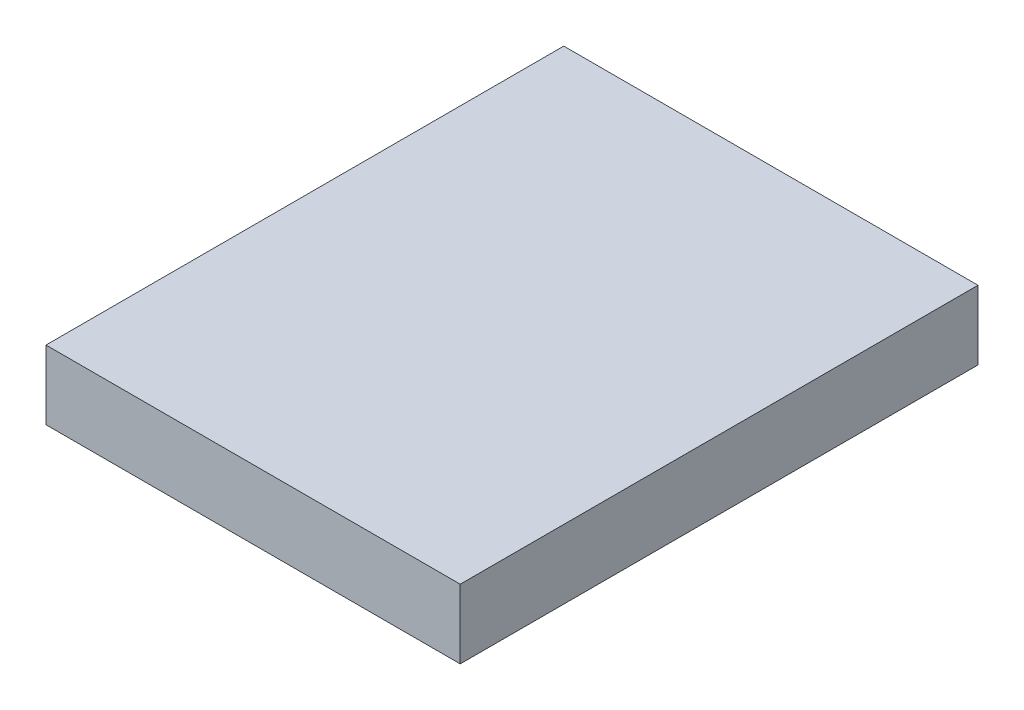
ISO-10303-21;
HEADER;
FILE_DESCRIPTION(('STEP AP214'),'2;1');
FILE_NAME('part.step','',(''),(''),'','','');
FILE_SCHEMA(('AUTOMOTIVE_DESIGN { 1 0 10303 214 1 1 1 1 }'));
ENDSEC;
DATA;
#1=APPLICATION_CONTEXT('core data for automotive mechanical design processes');
#2=APPLICATION_PROTOCOL_DEFINITION('international standard','automotive_design',2000,#1);
#3=PRODUCT_CONTEXT('',#1,'mechanical');
#4=PRODUCT('Part','Part','',(#3));
#5=PRODUCT_RELATED_PRODUCT_CATEGORY('part','',(#4));
#6=PRODUCT_DEFINITION_FORMATION('','',#4);
#7=PRODUCT_DEFINITION_CONTEXT('part definition',#1,'design');
#8=PRODUCT_DEFINITION('design','',#6,#7);
#9=PRODUCT_DEFINITION_SHAPE('','',#8);
#10=(LENGTH_UNIT() NAMED_UNIT(*) SI_UNIT(.MILLI.,.METRE.));
#11=(NAMED_UNIT(*) PLANE_ANGLE_UNIT() SI_UNIT($,.RADIAN.));
#12=(NAMED_UNIT(*) SI_UNIT($,.STERADIAN.) SOLID_ANGLE_UNIT());
#13=UNCERTAINTY_MEASURE_WITH_UNIT(LENGTH_MEASURE(1.E-05),#10,'distance_accuracy_value','');
#14=(GEOMETRIC_REPRESENTATION_CONTEXT(3) GLOBAL_UNCERTAINTY_ASSIGNED_CONTEXT((#13)) GLOBAL_UNIT_ASSIGNED_CONTEXT((#10,
#11,#12)) REPRESENTATION_CONTEXT('',''));
#15=CARTESIAN_POINT('',(0.,0.,0.));
#16=DIRECTION('',(0.,0.,1.));
#17=DIRECTION('',(1.,0.,0.));
#18=AXIS2_PLACEMENT_3D('',#15,#16,#17);
#19=CARTESIAN_POINT('',(0.,-1.,0.));
#20=DIRECTION('',(0.,0.,-1.));
#21=DIRECTION('',(-1.,0.,0.));
#22=AXIS2_PLACEMENT_3D('',#19,#20,#21);
#23=PLANE('',#22);
#24=DIRECTION('',(-1.,0.,0.));
#25=VECTOR('',#24,1.);
#26=CARTESIAN_POINT('',(0.,0.,0.));
#27=LINE('',#26,#25);
#28=CARTESIAN_POINT('',(6.00000000000001,0.,0.));
#29=VERTEX_POINT('',#28);
#30=CARTESIAN_POINT('',(0.,0.,0.));
#31=VERTEX_POINT('',#30);
#32=EDGE_CURVE('E80',#29,#31,#27,.T.);
#33=ORIENTED_EDGE('',*,*,#32,.F.);
#34=DIRECTION('',(0.,1.,0.));
#35=VECTOR('',#34,1.);
#36=CARTESIAN_POINT('',(6.00000000000001,-1.,0.));
#37=LINE('',#36,#35);
#38=CARTESIAN_POINT('',(6.00000000000001,-1.,0.));
#39=VERTEX_POINT('',#38);
#40=EDGE_CURVE('E73',#39,#29,#37,.T.);
#41=ORIENTED_EDGE('',*,*,#40,.F.);
#42=DIRECTION('',(-1.,0.,0.));
#43=VECTOR('',#42,1.);
#44=CARTESIAN_POINT('',(0.,-1.,0.));
#45=LINE('',#44,#43);
#46=CARTESIAN_POINT('',(0.,-1.,0.));
#47=VERTEX_POINT('',#46);
#48=EDGE_CURVE('E40',#39,#47,#45,.T.);
#49=ORIENTED_EDGE('',*,*,#48,.T.);
#50=DIRECTION('',(0.,1.,0.));
#51=VECTOR('',#50,1.);
#52=CARTESIAN_POINT('',(0.,-1.,0.));
#53=LINE('',#52,#51);
#54=EDGE_CURVE('E11',#47,#31,#53,.T.);
#55=ORIENTED_EDGE('',*,*,#54,.T.);
#56=EDGE_LOOP('',(#33,#41,#49,#55));
#57=FACE_BOUND('',#56,.T.);
#58=ADVANCED_FACE('F32',(#57),#23,.T.);
#59=CARTESIAN_POINT('',(0.,-1.,0.));
#60=DIRECTION('',(0.,1.,0.));
#61=DIRECTION('',(0.,0.,1.));
#62=AXIS2_PLACEMENT_3D('',#59,#60,#61);
#63=PLANE('',#62);
#64=DIRECTION('',(0.,0.,-1.));
#65=VECTOR('',#64,1.);
#66=CARTESIAN_POINT('',(6.00000000000001,-1.,0.));
#67=LINE('',#66,#65);
#68=CARTESIAN_POINT('',(6.,-1.,7.5));
#69=VERTEX_POINT('',#68);
#70=EDGE_CURVE('E71',#69,#39,#67,.T.);
#71=ORIENTED_EDGE('',*,*,#70,.F.);
#72=DIRECTION('',(-1.,0.,0.));
#73=VECTOR('',#72,1.);
#74=CARTESIAN_POINT('',(6.,-1.,7.5));
#75=LINE('',#74,#73);
#76=CARTESIAN_POINT('',(0.,-1.,7.5));
#77=VERTEX_POINT('',#76);
#78=EDGE_CURVE('E100',#69,#77,#75,.T.);
#79=ORIENTED_EDGE('',*,*,#78,.T.);
#80=DIRECTION('',(0.,0.,1.));
#81=VECTOR('',#80,1.);
#82=CARTESIAN_POINT('',(0.,-1.,0.));
#83=LINE('',#82,#81);
#84=EDGE_CURVE('E85',#47,#77,#83,.T.);
#85=ORIENTED_EDGE('',*,*,#84,.F.);
#86=ORIENTED_EDGE('',*,*,#48,.F.);
#87=EDGE_LOOP('',(#71,#79,#85,#86));
#88=FACE_BOUND('',#87,.T.);
#89=ADVANCED_FACE('F83',(#88),#63,.F.);
#90=CARTESIAN_POINT('',(0.,0.,0.));
#91=DIRECTION('',(0.,1.,0.));
#92=DIRECTION('',(0.,0.,1.));
#93=AXIS2_PLACEMENT_3D('',#90,#91,#92);
#94=PLANE('',#93);
#95=DIRECTION('',(-1.,0.,0.));
#96=VECTOR('',#95,1.);
#97=CARTESIAN_POINT('',(6.,0.,7.5));
#98=LINE('',#97,#96);
#99=CARTESIAN_POINT('',(6.,0.,7.5));
#100=VERTEX_POINT('',#99);
#101=CARTESIAN_POINT('',(0.,0.,7.5));
#102=VERTEX_POINT('',#101);
#103=EDGE_CURVE('E103',#100,#102,#98,.T.);
#104=ORIENTED_EDGE('',*,*,#103,.F.);
#105=DIRECTION('',(0.,0.,-1.));
#106=VECTOR('',#105,1.);
#107=CARTESIAN_POINT('',(6.00000000000001,0.,0.));
#108=LINE('',#107,#106);
#109=EDGE_CURVE('E47',#100,#29,#108,.T.);
#110=ORIENTED_EDGE('',*,*,#109,.T.);
#111=ORIENTED_EDGE('',*,*,#32,.T.);
#112=DIRECTION('',(0.,0.,1.));
#113=VECTOR('',#112,1.);
#114=CARTESIAN_POINT('',(0.,0.,0.));
#115=LINE('',#114,#113);
#116=EDGE_CURVE('E90',#31,#102,#115,.T.);
#117=ORIENTED_EDGE('',*,*,#116,.T.);
#118=EDGE_LOOP('',(#104,#110,#111,#117));
#119=FACE_BOUND('',#118,.T.);
#120=ADVANCED_FACE('F94',(#119),#94,.T.);
#121=CARTESIAN_POINT('',(0.,-1.,0.));
#122=DIRECTION('',(-1.,0.,0.));
#123=DIRECTION('',(0.,0.,1.));
#124=AXIS2_PLACEMENT_3D('',#121,#122,#123);
#125=PLANE('',#124);
#126=DIRECTION('',(0.,1.,0.));
#127=VECTOR('',#126,1.);
#128=CARTESIAN_POINT('',(0.,-1.,7.5));
#129=LINE('',#128,#127);
#130=EDGE_CURVE('E98',#77,#102,#129,.T.);
#131=ORIENTED_EDGE('',*,*,#130,.T.);
#132=ORIENTED_EDGE('',*,*,#116,.F.);
#133=ORIENTED_EDGE('',*,*,#54,.F.);
#134=ORIENTED_EDGE('',*,*,#84,.T.);
#135=EDGE_LOOP('',(#131,#132,#133,#134));
#136=FACE_BOUND('',#135,.T.);
#137=ADVANCED_FACE('F34',(#136),#125,.T.);
#138=CARTESIAN_POINT('',(6.00000000000001,-1.,0.));
#139=DIRECTION('',(1.,0.,0.));
#140=DIRECTION('',(0.,0.,-1.));
#141=AXIS2_PLACEMENT_3D('',#138,#139,#140);
#142=PLANE('',#141);
#143=ORIENTED_EDGE('',*,*,#70,.T.);
#144=ORIENTED_EDGE('',*,*,#40,.T.);
#145=ORIENTED_EDGE('',*,*,#109,.F.);
#146=DIRECTION('',(0.,1.,0.));
#147=VECTOR('',#146,1.);
#148=CARTESIAN_POINT('',(6.,-1.,7.5));
#149=LINE('',#148,#147);
#150=EDGE_CURVE('E74',#69,#100,#149,.T.);
#151=ORIENTED_EDGE('',*,*,#150,.F.);
#152=EDGE_LOOP('',(#143,#144,#145,#151));
#153=FACE_BOUND('',#152,.T.);
#154=ADVANCED_FACE('F72',(#153),#142,.T.);
#155=CARTESIAN_POINT('',(6.,-1.,7.5));
#156=DIRECTION('',(0.,0.,-1.));
#157=DIRECTION('',(-1.,0.,0.));
#158=AXIS2_PLACEMENT_3D('',#155,#156,#157);
#159=PLANE('',#158);
#160=ORIENTED_EDGE('',*,*,#103,.T.);
#161=ORIENTED_EDGE('',*,*,#130,.F.);
#162=ORIENTED_EDGE('',*,*,#78,.F.);
#163=ORIENTED_EDGE('',*,*,#150,.T.);
#164=EDGE_LOOP('',(#160,#161,#162,#163));
#165=FACE_BOUND('',#164,.T.);
#166=ADVANCED_FACE('F106',(#165),#159,.F.);
#167=CLOSED_SHELL('',(#58,#89,#120,#137,#154,#166));
#168=MANIFOLD_SOLID_BREP('B2',#167);
#169=ADVANCED_BREP_SHAPE_REPRESENTATION('',(#18,#168),#14);
#170=SHAPE_DEFINITION_REPRESENTATION(#9,#169);
ENDSEC;
END-ISO-10303-21;
